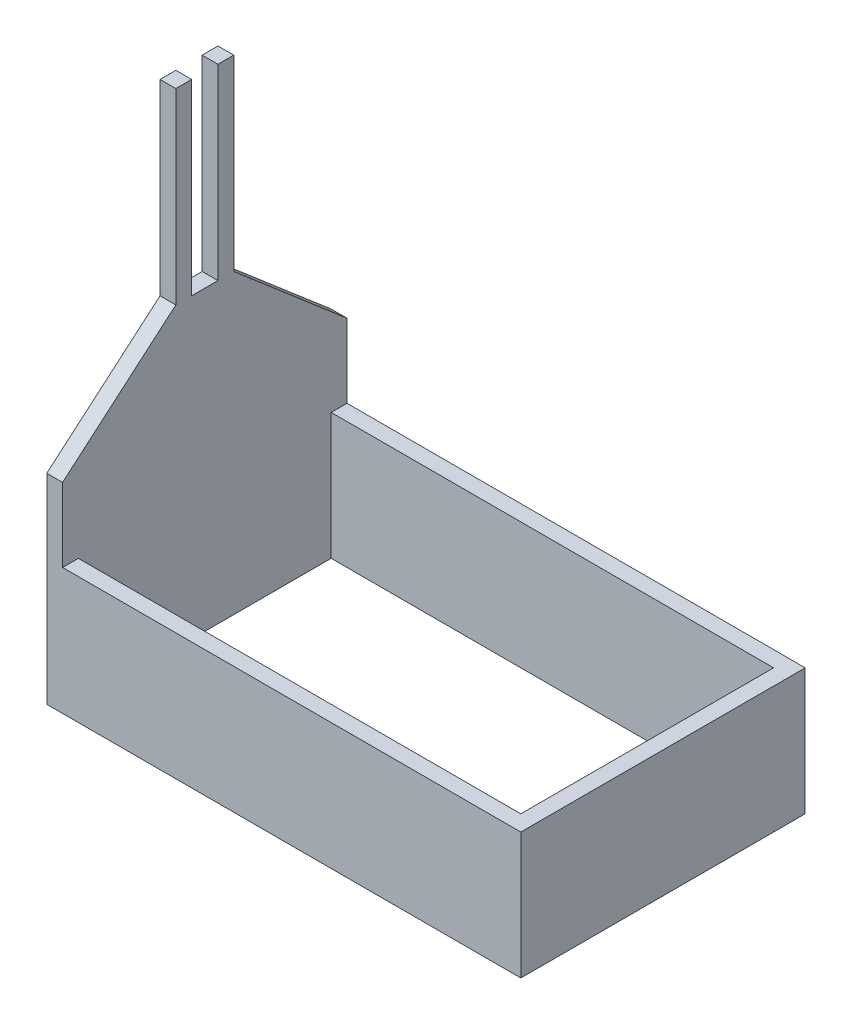
ISO-10303-21;
HEADER;
FILE_DESCRIPTION(('STEP AP214'),'2;1');
FILE_NAME('part.step','',(''),(''),'','','');
FILE_SCHEMA(('AUTOMOTIVE_DESIGN { 1 0 10303 214 1 1 1 1 }'));
ENDSEC;
DATA;
#1=APPLICATION_CONTEXT('core data for automotive mechanical design processes');
#2=APPLICATION_PROTOCOL_DEFINITION('international standard','automotive_design',2000,#1);
#3=PRODUCT_CONTEXT('',#1,'mechanical');
#4=PRODUCT('Part','Part','',(#3));
#5=PRODUCT_RELATED_PRODUCT_CATEGORY('part','',(#4));
#6=PRODUCT_DEFINITION_FORMATION('','',#4);
#7=PRODUCT_DEFINITION_CONTEXT('part definition',#1,'design');
#8=PRODUCT_DEFINITION('design','',#6,#7);
#9=PRODUCT_DEFINITION_SHAPE('','',#8);
#10=(LENGTH_UNIT() NAMED_UNIT(*) SI_UNIT(.MILLI.,.METRE.));
#11=(NAMED_UNIT(*) PLANE_ANGLE_UNIT() SI_UNIT($,.RADIAN.));
#12=(NAMED_UNIT(*) SI_UNIT($,.STERADIAN.) SOLID_ANGLE_UNIT());
#13=UNCERTAINTY_MEASURE_WITH_UNIT(LENGTH_MEASURE(1.E-05),#10,'distance_accuracy_value','');
#14=(GEOMETRIC_REPRESENTATION_CONTEXT(3) GLOBAL_UNCERTAINTY_ASSIGNED_CONTEXT((#13)) GLOBAL_UNIT_ASSIGNED_CONTEXT((#10,
#11,#12)) REPRESENTATION_CONTEXT('',''));
#15=CARTESIAN_POINT('',(0.,0.,0.));
#16=DIRECTION('',(0.,0.,1.));
#17=DIRECTION('',(1.,0.,0.));
#18=AXIS2_PLACEMENT_3D('',#15,#16,#17);
#19=CARTESIAN_POINT('',(0.,609.6,0.));
#20=DIRECTION('',(1.,0.,0.));
#21=DIRECTION('',(0.,0.,-1.));
#22=AXIS2_PLACEMENT_3D('',#19,#20,#21);
#23=PLANE('',#22);
#24=DIRECTION('',(0.,1.,0.));
#25=VECTOR('',#24,1.);
#26=CARTESIAN_POINT('',(0.,2336.8,-749.3));
#27=LINE('',#26,#25);
#28=CARTESIAN_POINT('',(0.,1433.15697562035,-749.3));
#29=VERTEX_POINT('',#28);
#30=CARTESIAN_POINT('',(0.,2336.8,-749.3));
#31=VERTEX_POINT('',#30);
#32=EDGE_CURVE('E397',#29,#31,#27,.T.);
#33=ORIENTED_EDGE('',*,*,#32,.T.);
#34=DIRECTION('',(0.,0.,1.));
#35=VECTOR('',#34,1.);
#36=CARTESIAN_POINT('',(0.,2336.8,-1371.6));
#37=LINE('',#36,#35);
#38=CARTESIAN_POINT('',(0.,2336.8,-825.5));
#39=VERTEX_POINT('',#38);
#40=EDGE_CURVE('E225',#39,#31,#37,.T.);
#41=ORIENTED_EDGE('',*,*,#40,.F.);
#42=DIRECTION('',(0.,-1.,0.));
#43=VECTOR('',#42,1.);
#44=CARTESIAN_POINT('',(0.,1433.15697562035,-825.5));
#45=LINE('',#44,#43);
#46=CARTESIAN_POINT('',(-1.77635683940025E-12,1433.15697562035,-825.5));
#47=VERTEX_POINT('',#46);
#48=EDGE_CURVE('E207',#39,#47,#45,.T.);
#49=ORIENTED_EDGE('',*,*,#48,.T.);
#50=DIRECTION('',(0.,-0.650756630515429,-0.759286380649755));
#51=VECTOR('',#50,1.);
#52=CARTESIAN_POINT('',(0.,965.114607179129,-1371.6));
#53=LINE('',#52,#51);
#54=CARTESIAN_POINT('',(-1.77635683940025E-12,965.114607179129,-1371.6));
#55=VERTEX_POINT('',#54);
#56=EDGE_CURVE('E210',#47,#55,#53,.T.);
#57=ORIENTED_EDGE('',*,*,#56,.T.);
#58=DIRECTION('',(0.,-1.,0.));
#59=VECTOR('',#58,1.);
#60=CARTESIAN_POINT('',(0.,609.6,-1371.6));
#61=LINE('',#60,#59);
#62=CARTESIAN_POINT('',(0.,0.,-1371.6));
#63=VERTEX_POINT('',#62);
#64=EDGE_CURVE('E266',#55,#63,#61,.T.);
#65=ORIENTED_EDGE('',*,*,#64,.T.);
#66=DIRECTION('',(0.,0.,1.));
#67=VECTOR('',#66,1.);
#68=CARTESIAN_POINT('',(0.,0.,0.));
#69=LINE('',#68,#67);
#70=CARTESIAN_POINT('',(0.,0.,0.));
#71=VERTEX_POINT('',#70);
#72=EDGE_CURVE('E288',#63,#71,#69,.T.);
#73=ORIENTED_EDGE('',*,*,#72,.T.);
#74=DIRECTION('',(0.,-1.,0.));
#75=VECTOR('',#74,1.);
#76=CARTESIAN_POINT('',(0.,609.6,0.));
#77=LINE('',#76,#75);
#78=CARTESIAN_POINT('',(0.,965.114607179129,0.));
#79=VERTEX_POINT('',#78);
#80=EDGE_CURVE('E241',#79,#71,#77,.T.);
#81=ORIENTED_EDGE('',*,*,#80,.F.);
#82=DIRECTION('',(0.,0.65075663051543,-0.759286380649755));
#83=VECTOR('',#82,1.);
#84=CARTESIAN_POINT('',(0.,1433.15697562035,-546.1));
#85=LINE('',#84,#83);
#86=CARTESIAN_POINT('',(0.,1433.15697562035,-546.1));
#87=VERTEX_POINT('',#86);
#88=EDGE_CURVE('E180',#79,#87,#85,.T.);
#89=ORIENTED_EDGE('',*,*,#88,.T.);
#90=DIRECTION('',(0.,1.,0.));
#91=VECTOR('',#90,1.);
#92=CARTESIAN_POINT('',(0.,2336.8,-546.1));
#93=LINE('',#92,#91);
#94=CARTESIAN_POINT('',(0.,2336.8,-546.1));
#95=VERTEX_POINT('',#94);
#96=EDGE_CURVE('E185',#87,#95,#93,.T.);
#97=ORIENTED_EDGE('',*,*,#96,.T.);
#98=CARTESIAN_POINT('',(0.,2336.8,-622.3));
#99=VERTEX_POINT('',#98);
#100=EDGE_CURVE('E229',#99,#95,#37,.T.);
#101=ORIENTED_EDGE('',*,*,#100,.F.);
#102=DIRECTION('',(0.,-1.,0.));
#103=VECTOR('',#102,1.);
#104=CARTESIAN_POINT('',(0.,1433.15697562035,-622.3));
#105=LINE('',#104,#103);
#106=CARTESIAN_POINT('',(0.,1433.15697562035,-622.3));
#107=VERTEX_POINT('',#106);
#108=EDGE_CURVE('E51',#99,#107,#105,.T.);
#109=ORIENTED_EDGE('',*,*,#108,.T.);
#110=DIRECTION('',(0.,0.,-1.));
#111=VECTOR('',#110,1.);
#112=CARTESIAN_POINT('',(0.,1433.15697562035,-749.3));
#113=LINE('',#112,#111);
#114=EDGE_CURVE('E46',#107,#29,#113,.T.);
#115=ORIENTED_EDGE('',*,*,#114,.T.);
#116=EDGE_LOOP('',(#33,#41,#49,#57,#65,#73,#81,#89,#97,#101,#109,#115));
#117=FACE_BOUND('',#116,.T.);
#118=ADVANCED_FACE('F32',(#117),#23,.F.);
#119=CARTESIAN_POINT('',(76.2,0.,-1295.4));
#120=DIRECTION('',(-1.,0.,0.));
#121=DIRECTION('',(0.,0.,1.));
#122=AXIS2_PLACEMENT_3D('',#119,#120,#121);
#123=PLANE('',#122);
#124=DIRECTION('',(0.,1.,0.));
#125=VECTOR('',#124,1.);
#126=CARTESIAN_POINT('',(76.2000000000001,0.,-749.299999999999));
#127=LINE('',#126,#125);
#128=CARTESIAN_POINT('',(76.2000000000001,1433.15697562035,-749.3));
#129=VERTEX_POINT('',#128);
#130=CARTESIAN_POINT('',(76.2000000000001,2336.8,-749.3));
#131=VERTEX_POINT('',#130);
#132=EDGE_CURVE('E204',#129,#131,#127,.T.);
#133=ORIENTED_EDGE('',*,*,#132,.F.);
#134=DIRECTION('',(0.,0.,-1.));
#135=VECTOR('',#134,1.);
#136=CARTESIAN_POINT('',(76.2,1433.15697562035,-1295.4));
#137=LINE('',#136,#135);
#138=CARTESIAN_POINT('',(76.2000000000001,1433.15697562035,-622.3));
#139=VERTEX_POINT('',#138);
#140=EDGE_CURVE('E11',#139,#129,#137,.T.);
#141=ORIENTED_EDGE('',*,*,#140,.F.);
#142=DIRECTION('',(0.,-1.,0.));
#143=VECTOR('',#142,1.);
#144=CARTESIAN_POINT('',(76.2000000000001,0.,-622.3));
#145=LINE('',#144,#143);
#146=CARTESIAN_POINT('',(76.2,2336.8,-622.3));
#147=VERTEX_POINT('',#146);
#148=EDGE_CURVE('E201',#147,#139,#145,.T.);
#149=ORIENTED_EDGE('',*,*,#148,.F.);
#150=DIRECTION('',(0.,0.,-1.));
#151=VECTOR('',#150,1.);
#152=CARTESIAN_POINT('',(76.2,2336.8,-1371.6));
#153=LINE('',#152,#151);
#154=CARTESIAN_POINT('',(76.2000000000001,2336.8,-546.1));
#155=VERTEX_POINT('',#154);
#156=EDGE_CURVE('E231',#155,#147,#153,.T.);
#157=ORIENTED_EDGE('',*,*,#156,.F.);
#158=DIRECTION('',(0.,1.,0.));
#159=VECTOR('',#158,1.);
#160=CARTESIAN_POINT('',(76.2000000000001,0.,-546.1));
#161=LINE('',#160,#159);
#162=CARTESIAN_POINT('',(76.2000000000001,1433.15697562035,-546.1));
#163=VERTEX_POINT('',#162);
#164=EDGE_CURVE('E172',#163,#155,#161,.T.);
#165=ORIENTED_EDGE('',*,*,#164,.F.);
#166=DIRECTION('',(0.,0.650756630515429,-0.759286380649755));
#167=VECTOR('',#166,1.);
#168=CARTESIAN_POINT('',(76.2000000000001,1196.47475910984,-269.945174814295));
#169=LINE('',#168,#167);
#170=CARTESIAN_POINT('',(76.2,965.114607179129,0.));
#171=VERTEX_POINT('',#170);
#172=EDGE_CURVE('E168',#171,#163,#169,.T.);
#173=ORIENTED_EDGE('',*,*,#172,.F.);
#174=DIRECTION('',(0.,-1.,0.));
#175=VECTOR('',#174,1.);
#176=CARTESIAN_POINT('',(76.2000000000002,2336.8,0.));
#177=LINE('',#176,#175);
#178=CARTESIAN_POINT('',(76.2000000000001,609.6,0.));
#179=VERTEX_POINT('',#178);
#180=EDGE_CURVE('E154',#171,#179,#177,.T.);
#181=ORIENTED_EDGE('',*,*,#180,.T.);
#182=DIRECTION('',(0.,0.,-1.));
#183=VECTOR('',#182,1.);
#184=CARTESIAN_POINT('',(76.2,609.6,-1371.6));
#185=LINE('',#184,#183);
#186=CARTESIAN_POINT('',(76.2000000000002,609.6,-76.1999999999998));
#187=VERTEX_POINT('',#186);
#188=EDGE_CURVE('E224',#179,#187,#185,.T.);
#189=ORIENTED_EDGE('',*,*,#188,.T.);
#190=DIRECTION('',(0.,1.,0.));
#191=VECTOR('',#190,1.);
#192=CARTESIAN_POINT('',(76.2000000000002,0.,-76.1999999999998));
#193=LINE('',#192,#191);
#194=CARTESIAN_POINT('',(76.2000000000002,0.,-76.1999999999998));
#195=VERTEX_POINT('',#194);
#196=EDGE_CURVE('E373',#195,#187,#193,.T.);
#197=ORIENTED_EDGE('',*,*,#196,.F.);
#198=DIRECTION('',(0.,0.,1.));
#199=VECTOR('',#198,1.);
#200=CARTESIAN_POINT('',(76.2,0.,-1295.4));
#201=LINE('',#200,#199);
#202=CARTESIAN_POINT('',(76.2,0.,-1295.4));
#203=VERTEX_POINT('',#202);
#204=EDGE_CURVE('E366',#203,#195,#201,.T.);
#205=ORIENTED_EDGE('',*,*,#204,.F.);
#206=DIRECTION('',(0.,1.,0.));
#207=VECTOR('',#206,1.);
#208=CARTESIAN_POINT('',(76.2,0.,-1295.4));
#209=LINE('',#208,#207);
#210=CARTESIAN_POINT('',(76.2,609.6,-1295.4));
#211=VERTEX_POINT('',#210);
#212=EDGE_CURVE('E247',#203,#211,#209,.T.);
#213=ORIENTED_EDGE('',*,*,#212,.T.);
#214=CARTESIAN_POINT('',(76.2,609.6,-1371.6));
#215=VERTEX_POINT('',#214);
#216=EDGE_CURVE('E237',#211,#215,#185,.T.);
#217=ORIENTED_EDGE('',*,*,#216,.T.);
#218=DIRECTION('',(0.,-1.,0.));
#219=VECTOR('',#218,1.);
#220=CARTESIAN_POINT('',(76.2,2336.8,-1371.6));
#221=LINE('',#220,#219);
#222=CARTESIAN_POINT('',(76.1999999999983,965.114607179129,-1371.6));
#223=VERTEX_POINT('',#222);
#224=EDGE_CURVE('E166',#223,#215,#221,.T.);
#225=ORIENTED_EDGE('',*,*,#224,.F.);
#226=DIRECTION('',(0.,-0.65075663051543,-0.759286380649755));
#227=VECTOR('',#226,1.);
#228=CARTESIAN_POINT('',(76.1999999999999,594.055058692351,-1804.54289810448));
#229=LINE('',#228,#227);
#230=CARTESIAN_POINT('',(76.1999999999983,1433.15697562035,-825.5));
#231=VERTEX_POINT('',#230);
#232=EDGE_CURVE('E39',#231,#223,#229,.T.);
#233=ORIENTED_EDGE('',*,*,#232,.F.);
#234=DIRECTION('',(0.,-1.,0.));
#235=VECTOR('',#234,1.);
#236=CARTESIAN_POINT('',(76.2000000000001,0.,-825.5));
#237=LINE('',#236,#235);
#238=CARTESIAN_POINT('',(76.1999999999983,2336.8,-825.5));
#239=VERTEX_POINT('',#238);
#240=EDGE_CURVE('E222',#239,#231,#237,.T.);
#241=ORIENTED_EDGE('',*,*,#240,.F.);
#242=EDGE_CURVE('E228',#131,#239,#153,.T.);
#243=ORIENTED_EDGE('',*,*,#242,.F.);
#244=EDGE_LOOP('',(#133,#141,#149,#157,#165,#173,#181,#189,#197,#205,#213,#217,#225,#233,#241,#243));
#245=FACE_BOUND('',#244,.T.);
#246=ADVANCED_FACE('F169',(#245),#123,.F.);
#247=CARTESIAN_POINT('',(0.,2336.8,0.));
#248=DIRECTION('',(0.,1.,0.));
#249=DIRECTION('',(0.,0.,1.));
#250=AXIS2_PLACEMENT_3D('',#247,#248,#249);
#251=PLANE('',#250);
#252=ORIENTED_EDGE('',*,*,#40,.T.);
#253=DIRECTION('',(1.,0.,0.));
#254=VECTOR('',#253,1.);
#255=CARTESIAN_POINT('',(-4431.37207559282,2336.8,-749.3));
#256=LINE('',#255,#254);
#257=EDGE_CURVE('E176',#31,#131,#256,.T.);
#258=ORIENTED_EDGE('',*,*,#257,.T.);
#259=ORIENTED_EDGE('',*,*,#242,.T.);
#260=DIRECTION('',(1.,0.,0.));
#261=VECTOR('',#260,1.);
#262=CARTESIAN_POINT('',(-7288.87207559281,2336.8,-825.5));
#263=LINE('',#262,#261);
#264=EDGE_CURVE('E216',#39,#239,#263,.T.);
#265=ORIENTED_EDGE('',*,*,#264,.F.);
#266=EDGE_LOOP('',(#252,#258,#259,#265));
#267=FACE_BOUND('',#266,.T.);
#268=ADVANCED_FACE('F323',(#267),#251,.T.);
#269=DIRECTION('',(1.,0.,0.));
#270=VECTOR('',#269,1.);
#271=CARTESIAN_POINT('',(-4431.37207559282,2336.8,-622.3));
#272=LINE('',#271,#270);
#273=EDGE_CURVE('E190',#99,#147,#272,.T.);
#274=ORIENTED_EDGE('',*,*,#273,.F.);
#275=ORIENTED_EDGE('',*,*,#100,.T.);
#276=DIRECTION('',(1.,0.,0.));
#277=VECTOR('',#276,1.);
#278=CARTESIAN_POINT('',(-4431.37207559282,2336.8,-546.1));
#279=LINE('',#278,#277);
#280=EDGE_CURVE('E183',#95,#155,#279,.T.);
#281=ORIENTED_EDGE('',*,*,#280,.T.);
#282=ORIENTED_EDGE('',*,*,#156,.T.);
#283=EDGE_LOOP('',(#274,#275,#281,#282));
#284=FACE_BOUND('',#283,.T.);
#285=ADVANCED_FACE('F328',(#284),#251,.T.);
#286=CARTESIAN_POINT('',(0.,609.6,0.));
#287=DIRECTION('',(0.,0.,-1.));
#288=DIRECTION('',(-1.,0.,0.));
#289=AXIS2_PLACEMENT_3D('',#286,#287,#288);
#290=PLANE('',#289);
#291=DIRECTION('',(1.,0.,0.));
#292=VECTOR('',#291,1.);
#293=CARTESIAN_POINT('',(-4431.37207559282,965.114607179129,0.));
#294=LINE('',#293,#292);
#295=EDGE_CURVE('E158',#79,#171,#294,.T.);
#296=ORIENTED_EDGE('',*,*,#295,.F.);
#297=ORIENTED_EDGE('',*,*,#80,.T.);
#298=DIRECTION('',(1.,0.,0.));
#299=VECTOR('',#298,1.);
#300=CARTESIAN_POINT('',(0.,0.,0.));
#301=LINE('',#300,#299);
#302=CARTESIAN_POINT('',(2286.,0.,0.));
#303=VERTEX_POINT('',#302);
#304=EDGE_CURVE('E291',#71,#303,#301,.T.);
#305=ORIENTED_EDGE('',*,*,#304,.T.);
#306=DIRECTION('',(0.,-1.,0.));
#307=VECTOR('',#306,1.);
#308=CARTESIAN_POINT('',(2286.,609.6,0.));
#309=LINE('',#308,#307);
#310=CARTESIAN_POINT('',(2286.,609.6,0.));
#311=VERTEX_POINT('',#310);
#312=EDGE_CURVE('E297',#311,#303,#309,.T.);
#313=ORIENTED_EDGE('',*,*,#312,.F.);
#314=DIRECTION('',(1.,0.,0.));
#315=VECTOR('',#314,1.);
#316=CARTESIAN_POINT('',(0.,609.6,0.));
#317=LINE('',#316,#315);
#318=EDGE_CURVE('E161',#179,#311,#317,.T.);
#319=ORIENTED_EDGE('',*,*,#318,.F.);
#320=ORIENTED_EDGE('',*,*,#180,.F.);
#321=EDGE_LOOP('',(#296,#297,#305,#313,#319,#320));
#322=FACE_BOUND('',#321,.T.);
#323=ADVANCED_FACE('F156',(#322),#290,.F.);
#324=CARTESIAN_POINT('',(0.,609.6,-1371.6));
#325=DIRECTION('',(0.,0.,1.));
#326=DIRECTION('',(1.,0.,0.));
#327=AXIS2_PLACEMENT_3D('',#324,#325,#326);
#328=PLANE('',#327);
#329=DIRECTION('',(1.,0.,0.));
#330=VECTOR('',#329,1.);
#331=CARTESIAN_POINT('',(-7288.87207559281,965.114607179129,-1371.6));
#332=LINE('',#331,#330);
#333=EDGE_CURVE('E213',#55,#223,#332,.T.);
#334=ORIENTED_EDGE('',*,*,#333,.T.);
#335=ORIENTED_EDGE('',*,*,#224,.T.);
#336=DIRECTION('',(-1.,0.,0.));
#337=VECTOR('',#336,1.);
#338=CARTESIAN_POINT('',(0.,609.6,-1371.6));
#339=LINE('',#338,#337);
#340=CARTESIAN_POINT('',(2286.,609.6,-1371.6));
#341=VERTEX_POINT('',#340);
#342=EDGE_CURVE('E242',#341,#215,#339,.T.);
#343=ORIENTED_EDGE('',*,*,#342,.F.);
#344=DIRECTION('',(0.,-1.,0.));
#345=VECTOR('',#344,1.);
#346=CARTESIAN_POINT('',(2286.,609.6,-1371.6));
#347=LINE('',#346,#345);
#348=CARTESIAN_POINT('',(2286.,0.,-1371.6));
#349=VERTEX_POINT('',#348);
#350=EDGE_CURVE('E279',#341,#349,#347,.T.);
#351=ORIENTED_EDGE('',*,*,#350,.T.);
#352=DIRECTION('',(-1.,0.,0.));
#353=VECTOR('',#352,1.);
#354=CARTESIAN_POINT('',(0.,0.,-1371.6));
#355=LINE('',#354,#353);
#356=EDGE_CURVE('E282',#349,#63,#355,.T.);
#357=ORIENTED_EDGE('',*,*,#356,.T.);
#358=ORIENTED_EDGE('',*,*,#64,.F.);
#359=EDGE_LOOP('',(#334,#335,#343,#351,#357,#358));
#360=FACE_BOUND('',#359,.T.);
#361=ADVANCED_FACE('F262',(#360),#328,.F.);
#362=CARTESIAN_POINT('',(0.,609.6,0.));
#363=DIRECTION('',(0.,-1.,0.));
#364=DIRECTION('',(0.,0.,-1.));
#365=AXIS2_PLACEMENT_3D('',#362,#363,#364);
#366=PLANE('',#365);
#367=ORIENTED_EDGE('',*,*,#188,.F.);
#368=ORIENTED_EDGE('',*,*,#318,.T.);
#369=DIRECTION('',(0.,0.,-1.));
#370=VECTOR('',#369,1.);
#371=CARTESIAN_POINT('',(2286.,609.6,0.));
#372=LINE('',#371,#370);
#373=EDGE_CURVE('E276',#311,#341,#372,.T.);
#374=ORIENTED_EDGE('',*,*,#373,.T.);
#375=ORIENTED_EDGE('',*,*,#342,.T.);
#376=ORIENTED_EDGE('',*,*,#216,.F.);
#377=DIRECTION('',(-1.,0.,0.));
#378=VECTOR('',#377,1.);
#379=CARTESIAN_POINT('',(76.2,609.6,-1295.4));
#380=LINE('',#379,#378);
#381=CARTESIAN_POINT('',(2209.8,609.6,-1295.4));
#382=VERTEX_POINT('',#381);
#383=EDGE_CURVE('E274',#382,#211,#380,.T.);
#384=ORIENTED_EDGE('',*,*,#383,.F.);
#385=DIRECTION('',(0.,0.,-1.));
#386=VECTOR('',#385,1.);
#387=CARTESIAN_POINT('',(2209.8,609.6,-1295.4));
#388=LINE('',#387,#386);
#389=CARTESIAN_POINT('',(2209.8,609.6,-76.1999999999998));
#390=VERTEX_POINT('',#389);
#391=EDGE_CURVE('E358',#390,#382,#388,.T.);
#392=ORIENTED_EDGE('',*,*,#391,.F.);
#393=DIRECTION('',(1.,0.,0.));
#394=VECTOR('',#393,1.);
#395=CARTESIAN_POINT('',(76.2000000000002,609.6,-76.1999999999998));
#396=LINE('',#395,#394);
#397=EDGE_CURVE('E165',#187,#390,#396,.T.);
#398=ORIENTED_EDGE('',*,*,#397,.F.);
#399=EDGE_LOOP('',(#367,#368,#374,#375,#376,#384,#392,#398));
#400=FACE_BOUND('',#399,.T.);
#401=ADVANCED_FACE('F272',(#400),#366,.F.);
#402=CARTESIAN_POINT('',(2286.,609.6,0.));
#403=DIRECTION('',(-1.,0.,0.));
#404=DIRECTION('',(0.,0.,1.));
#405=AXIS2_PLACEMENT_3D('',#402,#403,#404);
#406=PLANE('',#405);
#407=DIRECTION('',(0.,0.,-1.));
#408=VECTOR('',#407,1.);
#409=CARTESIAN_POINT('',(2286.,0.,0.));
#410=LINE('',#409,#408);
#411=EDGE_CURVE('E293',#303,#349,#410,.T.);
#412=ORIENTED_EDGE('',*,*,#411,.T.);
#413=ORIENTED_EDGE('',*,*,#350,.F.);
#414=ORIENTED_EDGE('',*,*,#373,.F.);
#415=ORIENTED_EDGE('',*,*,#312,.T.);
#416=EDGE_LOOP('',(#412,#413,#414,#415));
#417=FACE_BOUND('',#416,.T.);
#418=ADVANCED_FACE('F307',(#417),#406,.F.);
#419=CARTESIAN_POINT('',(0.,0.,0.));
#420=DIRECTION('',(0.,-1.,0.));
#421=DIRECTION('',(0.,0.,-1.));
#422=AXIS2_PLACEMENT_3D('',#419,#420,#421);
#423=PLANE('',#422);
#424=ORIENTED_EDGE('',*,*,#204,.T.);
#425=DIRECTION('',(1.,0.,0.));
#426=VECTOR('',#425,1.);
#427=CARTESIAN_POINT('',(76.2000000000002,0.,-76.1999999999998));
#428=LINE('',#427,#426);
#429=CARTESIAN_POINT('',(2209.8,0.,-76.1999999999998));
#430=VERTEX_POINT('',#429);
#431=EDGE_CURVE('E386',#195,#430,#428,.T.);
#432=ORIENTED_EDGE('',*,*,#431,.T.);
#433=DIRECTION('',(0.,0.,-1.));
#434=VECTOR('',#433,1.);
#435=CARTESIAN_POINT('',(2209.8,0.,-1295.4));
#436=LINE('',#435,#434);
#437=CARTESIAN_POINT('',(2209.8,0.,-1295.4));
#438=VERTEX_POINT('',#437);
#439=EDGE_CURVE('E377',#430,#438,#436,.T.);
#440=ORIENTED_EDGE('',*,*,#439,.T.);
#441=DIRECTION('',(-1.,0.,0.));
#442=VECTOR('',#441,1.);
#443=CARTESIAN_POINT('',(76.2,0.,-1295.4));
#444=LINE('',#443,#442);
#445=EDGE_CURVE('E371',#438,#203,#444,.T.);
#446=ORIENTED_EDGE('',*,*,#445,.T.);
#447=EDGE_LOOP('',(#424,#432,#440,#446));
#448=FACE_BOUND('',#447,.T.);
#449=ORIENTED_EDGE('',*,*,#72,.F.);
#450=ORIENTED_EDGE('',*,*,#356,.F.);
#451=ORIENTED_EDGE('',*,*,#411,.F.);
#452=ORIENTED_EDGE('',*,*,#304,.F.);
#453=EDGE_LOOP('',(#449,#450,#451,#452));
#454=FACE_BOUND('',#453,.T.);
#455=ADVANCED_FACE('F304',(#448,#454),#423,.T.);
#456=CARTESIAN_POINT('',(76.2,0.,-1295.4));
#457=DIRECTION('',(0.,0.,-1.));
#458=DIRECTION('',(-1.,0.,0.));
#459=AXIS2_PLACEMENT_3D('',#456,#457,#458);
#460=PLANE('',#459);
#461=ORIENTED_EDGE('',*,*,#383,.T.);
#462=ORIENTED_EDGE('',*,*,#212,.F.);
#463=ORIENTED_EDGE('',*,*,#445,.F.);
#464=DIRECTION('',(0.,1.,0.));
#465=VECTOR('',#464,1.);
#466=CARTESIAN_POINT('',(2209.8,0.,-1295.4));
#467=LINE('',#466,#465);
#468=EDGE_CURVE('E359',#438,#382,#467,.T.);
#469=ORIENTED_EDGE('',*,*,#468,.T.);
#470=EDGE_LOOP('',(#461,#462,#463,#469));
#471=FACE_BOUND('',#470,.T.);
#472=ADVANCED_FACE('F314',(#471),#460,.F.);
#473=CARTESIAN_POINT('',(2209.8,0.,-1295.4));
#474=DIRECTION('',(1.,0.,0.));
#475=DIRECTION('',(0.,0.,-1.));
#476=AXIS2_PLACEMENT_3D('',#473,#474,#475);
#477=PLANE('',#476);
#478=ORIENTED_EDGE('',*,*,#391,.T.);
#479=ORIENTED_EDGE('',*,*,#468,.F.);
#480=ORIENTED_EDGE('',*,*,#439,.F.);
#481=DIRECTION('',(0.,1.,0.));
#482=VECTOR('',#481,1.);
#483=CARTESIAN_POINT('',(2209.8,0.,-76.1999999999998));
#484=LINE('',#483,#482);
#485=EDGE_CURVE('E362',#430,#390,#484,.T.);
#486=ORIENTED_EDGE('',*,*,#485,.T.);
#487=EDGE_LOOP('',(#478,#479,#480,#486));
#488=FACE_BOUND('',#487,.T.);
#489=ADVANCED_FACE('F349',(#488),#477,.F.);
#490=CARTESIAN_POINT('',(76.2000000000002,0.,-76.1999999999998));
#491=DIRECTION('',(0.,0.,1.));
#492=DIRECTION('',(1.,0.,0.));
#493=AXIS2_PLACEMENT_3D('',#490,#491,#492);
#494=PLANE('',#493);
#495=ORIENTED_EDGE('',*,*,#397,.T.);
#496=ORIENTED_EDGE('',*,*,#485,.F.);
#497=ORIENTED_EDGE('',*,*,#431,.F.);
#498=ORIENTED_EDGE('',*,*,#196,.T.);
#499=EDGE_LOOP('',(#495,#496,#497,#498));
#500=FACE_BOUND('',#499,.T.);
#501=ADVANCED_FACE('F332',(#500),#494,.F.);
#502=CARTESIAN_POINT('',(-7288.87207559281,965.114607179129,-1371.6));
#503=DIRECTION('',(0.,0.759286380649755,-0.650756630515429));
#504=DIRECTION('',(0.,0.65075663051543,0.759286380649755));
#505=AXIS2_PLACEMENT_3D('',#502,#503,#504);
#506=PLANE('',#505);
#507=DIRECTION('',(1.,0.,0.));
#508=VECTOR('',#507,1.);
#509=CARTESIAN_POINT('',(-7288.87207559281,1433.15697562035,-825.5));
#510=LINE('',#509,#508);
#511=EDGE_CURVE('E219',#47,#231,#510,.T.);
#512=ORIENTED_EDGE('',*,*,#511,.T.);
#513=ORIENTED_EDGE('',*,*,#232,.T.);
#514=ORIENTED_EDGE('',*,*,#333,.F.);
#515=ORIENTED_EDGE('',*,*,#56,.F.);
#516=EDGE_LOOP('',(#512,#513,#514,#515));
#517=FACE_BOUND('',#516,.T.);
#518=ADVANCED_FACE('F256',(#517),#506,.T.);
#519=CARTESIAN_POINT('',(-7288.87207559281,1433.15697562035,-825.5));
#520=DIRECTION('',(0.,0.,-1.));
#521=DIRECTION('',(-1.,0.,0.));
#522=AXIS2_PLACEMENT_3D('',#519,#520,#521);
#523=PLANE('',#522);
#524=ORIENTED_EDGE('',*,*,#264,.T.);
#525=ORIENTED_EDGE('',*,*,#240,.T.);
#526=ORIENTED_EDGE('',*,*,#511,.F.);
#527=ORIENTED_EDGE('',*,*,#48,.F.);
#528=EDGE_LOOP('',(#524,#525,#526,#527));
#529=FACE_BOUND('',#528,.T.);
#530=ADVANCED_FACE('F346',(#529),#523,.T.);
#531=CARTESIAN_POINT('',(-4431.37207559282,1433.15697562035,-546.1));
#532=DIRECTION('',(0.,0.759286380649755,0.650756630515429));
#533=DIRECTION('',(0.,-0.650756630515429,0.759286380649755));
#534=AXIS2_PLACEMENT_3D('',#531,#532,#533);
#535=PLANE('',#534);
#536=ORIENTED_EDGE('',*,*,#295,.T.);
#537=ORIENTED_EDGE('',*,*,#172,.T.);
#538=DIRECTION('',(1.,0.,0.));
#539=VECTOR('',#538,1.);
#540=CARTESIAN_POINT('',(-4431.37207559282,1433.15697562035,-546.1));
#541=LINE('',#540,#539);
#542=EDGE_CURVE('E181',#87,#163,#541,.T.);
#543=ORIENTED_EDGE('',*,*,#542,.F.);
#544=ORIENTED_EDGE('',*,*,#88,.F.);
#545=EDGE_LOOP('',(#536,#537,#543,#544));
#546=FACE_BOUND('',#545,.T.);
#547=ADVANCED_FACE('F179',(#546),#535,.T.);
#548=CARTESIAN_POINT('',(-4431.37207559282,2336.8,-546.1));
#549=DIRECTION('',(0.,0.,1.));
#550=DIRECTION('',(1.,0.,0.));
#551=AXIS2_PLACEMENT_3D('',#548,#549,#550);
#552=PLANE('',#551);
#553=ORIENTED_EDGE('',*,*,#542,.T.);
#554=ORIENTED_EDGE('',*,*,#164,.T.);
#555=ORIENTED_EDGE('',*,*,#280,.F.);
#556=ORIENTED_EDGE('',*,*,#96,.F.);
#557=EDGE_LOOP('',(#553,#554,#555,#556));
#558=FACE_BOUND('',#557,.T.);
#559=ADVANCED_FACE('F393',(#558),#552,.T.);
#560=CARTESIAN_POINT('',(-4431.37207559282,1433.15697562035,-749.3));
#561=DIRECTION('',(0.,1.,0.));
#562=DIRECTION('',(0.,0.,1.));
#563=AXIS2_PLACEMENT_3D('',#560,#561,#562);
#564=PLANE('',#563);
#565=DIRECTION('',(1.,0.,0.));
#566=VECTOR('',#565,1.);
#567=CARTESIAN_POINT('',(-4431.37207559282,1433.15697562035,-622.3));
#568=LINE('',#567,#566);
#569=EDGE_CURVE('E193',#107,#139,#568,.T.);
#570=ORIENTED_EDGE('',*,*,#569,.T.);
#571=ORIENTED_EDGE('',*,*,#140,.T.);
#572=DIRECTION('',(1.,0.,0.));
#573=VECTOR('',#572,1.);
#574=CARTESIAN_POINT('',(-4431.37207559282,1433.15697562035,-749.3));
#575=LINE('',#574,#573);
#576=EDGE_CURVE('E196',#29,#129,#575,.T.);
#577=ORIENTED_EDGE('',*,*,#576,.F.);
#578=ORIENTED_EDGE('',*,*,#114,.F.);
#579=EDGE_LOOP('',(#570,#571,#577,#578));
#580=FACE_BOUND('',#579,.T.);
#581=ADVANCED_FACE('F407',(#580),#564,.T.);
#582=CARTESIAN_POINT('',(-4431.37207559282,2336.8,-749.3));
#583=DIRECTION('',(0.,0.,1.));
#584=DIRECTION('',(0.,-1.,0.));
#585=AXIS2_PLACEMENT_3D('',#582,#583,#584);
#586=PLANE('',#585);
#587=ORIENTED_EDGE('',*,*,#576,.T.);
#588=ORIENTED_EDGE('',*,*,#132,.T.);
#589=ORIENTED_EDGE('',*,*,#257,.F.);
#590=ORIENTED_EDGE('',*,*,#32,.F.);
#591=EDGE_LOOP('',(#587,#588,#589,#590));
#592=FACE_BOUND('',#591,.T.);
#593=ADVANCED_FACE('F404',(#592),#586,.T.);
#594=CARTESIAN_POINT('',(-4431.37207559282,1433.15697562035,-622.3));
#595=DIRECTION('',(0.,0.,-1.));
#596=DIRECTION('',(-1.,0.,0.));
#597=AXIS2_PLACEMENT_3D('',#594,#595,#596);
#598=PLANE('',#597);
#599=ORIENTED_EDGE('',*,*,#273,.T.);
#600=ORIENTED_EDGE('',*,*,#148,.T.);
#601=ORIENTED_EDGE('',*,*,#569,.F.);
#602=ORIENTED_EDGE('',*,*,#108,.F.);
#603=EDGE_LOOP('',(#599,#600,#601,#602));
#604=FACE_BOUND('',#603,.T.);
#605=ADVANCED_FACE('F410',(#604),#598,.T.);
#606=CLOSED_SHELL('',(#118,#246,#268,#285,#323,#361,#401,#418,#455,#472,#489,#501,#518,#530,
#547,#559,#581,#593,#605));
#607=MANIFOLD_SOLID_BREP('B2',#606);
#608=ADVANCED_BREP_SHAPE_REPRESENTATION('',(#18,#607),#14);
#609=SHAPE_DEFINITION_REPRESENTATION(#9,#608);
ENDSEC;
END-ISO-10303-21;
